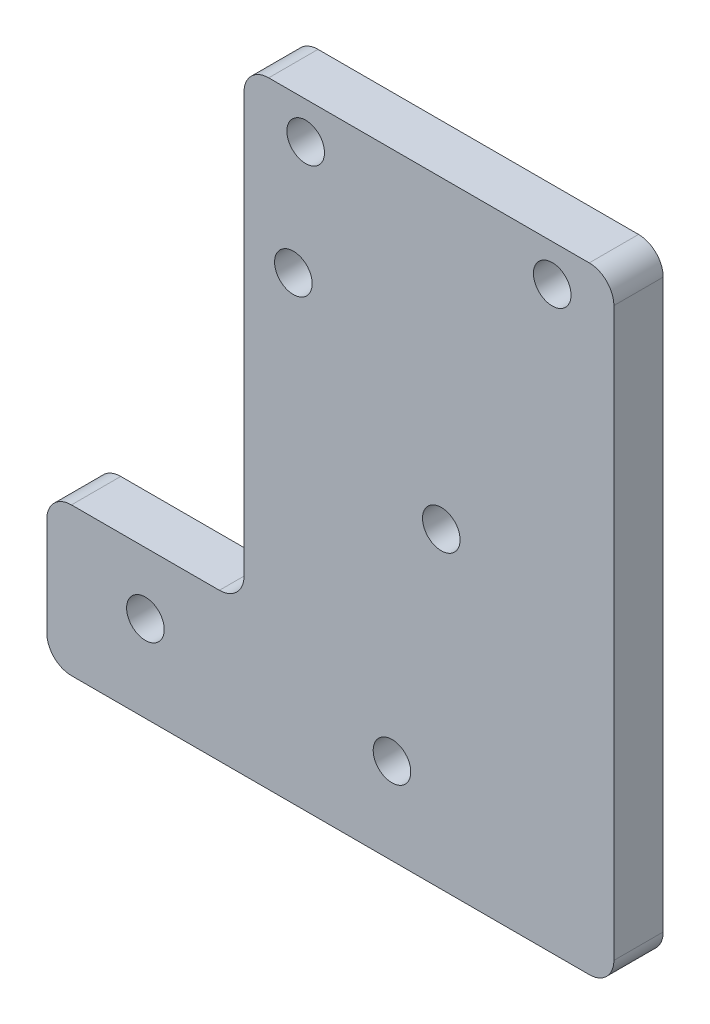
ISO-10303-21;
HEADER;
FILE_DESCRIPTION(('STEP AP214'),'2;1');
FILE_NAME('part.step','',(''),(''),'','','');
FILE_SCHEMA(('AUTOMOTIVE_DESIGN { 1 0 10303 214 1 1 1 1 }'));
ENDSEC;
DATA;
#1=APPLICATION_CONTEXT('core data for automotive mechanical design processes');
#2=APPLICATION_PROTOCOL_DEFINITION('international standard','automotive_design',2000,#1);
#3=PRODUCT_CONTEXT('',#1,'mechanical');
#4=PRODUCT('Part','Part','',(#3));
#5=PRODUCT_RELATED_PRODUCT_CATEGORY('part','',(#4));
#6=PRODUCT_DEFINITION_FORMATION('','',#4);
#7=PRODUCT_DEFINITION_CONTEXT('part definition',#1,'design');
#8=PRODUCT_DEFINITION('design','',#6,#7);
#9=PRODUCT_DEFINITION_SHAPE('','',#8);
#10=(LENGTH_UNIT() NAMED_UNIT(*) SI_UNIT(.MILLI.,.METRE.));
#11=(NAMED_UNIT(*) PLANE_ANGLE_UNIT() SI_UNIT($,.RADIAN.));
#12=(NAMED_UNIT(*) SI_UNIT($,.STERADIAN.) SOLID_ANGLE_UNIT());
#13=UNCERTAINTY_MEASURE_WITH_UNIT(LENGTH_MEASURE(1.E-05),#10,'distance_accuracy_value','');
#14=(GEOMETRIC_REPRESENTATION_CONTEXT(3) GLOBAL_UNCERTAINTY_ASSIGNED_CONTEXT((#13)) GLOBAL_UNIT_ASSIGNED_CONTEXT((#10,
#11,#12)) REPRESENTATION_CONTEXT('',''));
#15=CARTESIAN_POINT('',(0.,0.,0.));
#16=DIRECTION('',(0.,0.,1.));
#17=DIRECTION('',(1.,0.,0.));
#18=AXIS2_PLACEMENT_3D('',#15,#16,#17);
#19=CARTESIAN_POINT('',(15.,-15.,2.));
#20=DIRECTION('',(-1.,0.,0.));
#21=DIRECTION('',(0.,0.,1.));
#22=AXIS2_PLACEMENT_3D('',#19,#20,#21);
#23=PLANE('',#22);
#24=DIRECTION('',(0.,1.,0.));
#25=VECTOR('',#24,1.);
#26=CARTESIAN_POINT('',(15.,-15.,-2.));
#27=LINE('',#26,#25);
#28=CARTESIAN_POINT('',(15.,-33.,-2.));
#29=VERTEX_POINT('',#28);
#30=CARTESIAN_POINT('',(15.,13.,-2.));
#31=VERTEX_POINT('',#30);
#32=EDGE_CURVE('E152',#29,#31,#27,.T.);
#33=ORIENTED_EDGE('',*,*,#32,.T.);
#34=DIRECTION('',(0.,0.,-1.));
#35=VECTOR('',#34,1.);
#36=CARTESIAN_POINT('',(15.,13.,2.));
#37=LINE('',#36,#35);
#38=CARTESIAN_POINT('',(15.,13.,2.));
#39=VERTEX_POINT('',#38);
#40=EDGE_CURVE('E130',#31,#39,#37,.F.);
#41=ORIENTED_EDGE('',*,*,#40,.T.);
#42=DIRECTION('',(0.,1.,0.));
#43=VECTOR('',#42,1.);
#44=CARTESIAN_POINT('',(15.,-15.,2.));
#45=LINE('',#44,#43);
#46=CARTESIAN_POINT('',(15.,-33.,2.));
#47=VERTEX_POINT('',#46);
#48=EDGE_CURVE('E155',#47,#39,#45,.T.);
#49=ORIENTED_EDGE('',*,*,#48,.F.);
#50=DIRECTION('',(0.,0.,1.));
#51=VECTOR('',#50,1.);
#52=CARTESIAN_POINT('',(15.,-33.,-2.));
#53=LINE('',#52,#51);
#54=EDGE_CURVE('E135',#47,#29,#53,.F.);
#55=ORIENTED_EDGE('',*,*,#54,.T.);
#56=EDGE_LOOP('',(#33,#41,#49,#55));
#57=FACE_BOUND('',#56,.T.);
#58=ADVANCED_FACE('F35',(#57),#23,.F.);
#59=CARTESIAN_POINT('',(-15.,15.,2.));
#60=DIRECTION('',(0.,-1.,0.));
#61=DIRECTION('',(0.,0.,-1.));
#62=AXIS2_PLACEMENT_3D('',#59,#60,#61);
#63=PLANE('',#62);
#64=DIRECTION('',(-1.,0.,0.));
#65=VECTOR('',#64,1.);
#66=CARTESIAN_POINT('',(-15.,15.,2.));
#67=LINE('',#66,#65);
#68=CARTESIAN_POINT('',(13.,15.,2.));
#69=VERTEX_POINT('',#68);
#70=CARTESIAN_POINT('',(-13.,15.,2.));
#71=VERTEX_POINT('',#70);
#72=EDGE_CURVE('E145',#69,#71,#67,.T.);
#73=ORIENTED_EDGE('',*,*,#72,.F.);
#74=DIRECTION('',(0.,0.,-1.));
#75=VECTOR('',#74,1.);
#76=CARTESIAN_POINT('',(13.,15.,2.));
#77=LINE('',#76,#75);
#78=CARTESIAN_POINT('',(13.,15.,-2.));
#79=VERTEX_POINT('',#78);
#80=EDGE_CURVE('E129',#69,#79,#77,.T.);
#81=ORIENTED_EDGE('',*,*,#80,.T.);
#82=DIRECTION('',(-1.,0.,0.));
#83=VECTOR('',#82,1.);
#84=CARTESIAN_POINT('',(-15.,15.,-2.));
#85=LINE('',#84,#83);
#86=CARTESIAN_POINT('',(-13.,15.,-2.));
#87=VERTEX_POINT('',#86);
#88=EDGE_CURVE('E142',#79,#87,#85,.T.);
#89=ORIENTED_EDGE('',*,*,#88,.T.);
#90=DIRECTION('',(0.,0.,-1.));
#91=VECTOR('',#90,1.);
#92=CARTESIAN_POINT('',(-13.,15.,2.));
#93=LINE('',#92,#91);
#94=EDGE_CURVE('E147',#87,#71,#93,.F.);
#95=ORIENTED_EDGE('',*,*,#94,.T.);
#96=EDGE_LOOP('',(#73,#81,#89,#95));
#97=FACE_BOUND('',#96,.T.);
#98=ADVANCED_FACE('F141',(#97),#63,.F.);
#99=CARTESIAN_POINT('',(-15.,-15.,2.));
#100=DIRECTION('',(1.,0.,0.));
#101=DIRECTION('',(0.,0.,-1.));
#102=AXIS2_PLACEMENT_3D('',#99,#100,#101);
#103=PLANE('',#102);
#104=DIRECTION('',(0.,-1.,0.));
#105=VECTOR('',#104,1.);
#106=CARTESIAN_POINT('',(-15.,-15.,2.));
#107=LINE('',#106,#105);
#108=CARTESIAN_POINT('',(-15.,13.,2.));
#109=VERTEX_POINT('',#108);
#110=CARTESIAN_POINT('',(-15.,-21.,2.));
#111=VERTEX_POINT('',#110);
#112=EDGE_CURVE('E175',#109,#111,#107,.T.);
#113=ORIENTED_EDGE('',*,*,#112,.F.);
#114=DIRECTION('',(0.,0.,-1.));
#115=VECTOR('',#114,1.);
#116=CARTESIAN_POINT('',(-15.,13.,2.));
#117=LINE('',#116,#115);
#118=CARTESIAN_POINT('',(-15.,13.,-2.));
#119=VERTEX_POINT('',#118);
#120=EDGE_CURVE('E196',#109,#119,#117,.T.);
#121=ORIENTED_EDGE('',*,*,#120,.T.);
#122=DIRECTION('',(0.,-1.,0.));
#123=VECTOR('',#122,1.);
#124=CARTESIAN_POINT('',(-15.,-15.,-2.));
#125=LINE('',#124,#123);
#126=CARTESIAN_POINT('',(-15.,-21.,-2.));
#127=VERTEX_POINT('',#126);
#128=EDGE_CURVE('E151',#119,#127,#125,.T.);
#129=ORIENTED_EDGE('',*,*,#128,.T.);
#130=DIRECTION('',(0.,0.,1.));
#131=VECTOR('',#130,1.);
#132=CARTESIAN_POINT('',(-15.,-21.,2.));
#133=LINE('',#132,#131);
#134=EDGE_CURVE('E193',#127,#111,#133,.T.);
#135=ORIENTED_EDGE('',*,*,#134,.T.);
#136=EDGE_LOOP('',(#113,#121,#129,#135));
#137=FACE_BOUND('',#136,.T.);
#138=ADVANCED_FACE('F234',(#137),#103,.F.);
#139=CARTESIAN_POINT('',(0.,0.,2.));
#140=DIRECTION('',(0.,0.,-1.));
#141=DIRECTION('',(-1.,0.,0.));
#142=AXIS2_PLACEMENT_3D('',#139,#140,#141);
#143=PLANE('',#142);
#144=CARTESIAN_POINT('',(-2.99999999999999,-28.,2.));
#145=DIRECTION('',(0.,0.,-1.));
#146=DIRECTION('',(-1.,0.,0.));
#147=AXIS2_PLACEMENT_3D('',#144,#145,#146);
#148=CIRCLE('',#147,1.525);
#149=CARTESIAN_POINT('',(-4.52499999999999,-28.,2.));
#150=VERTEX_POINT('',#149);
#151=EDGE_CURVE('E228',#150,#150,#148,.T.);
#152=ORIENTED_EDGE('',*,*,#151,.T.);
#153=EDGE_LOOP('',(#152));
#154=FACE_BOUND('',#153,.T.);
#155=CARTESIAN_POINT('',(-23.,-28.,2.));
#156=DIRECTION('',(0.,0.,-1.));
#157=DIRECTION('',(-1.,0.,0.));
#158=AXIS2_PLACEMENT_3D('',#155,#156,#157);
#159=CIRCLE('',#158,1.525);
#160=CARTESIAN_POINT('',(-24.525,-28.,2.));
#161=VERTEX_POINT('',#160);
#162=EDGE_CURVE('E264',#161,#161,#159,.T.);
#163=ORIENTED_EDGE('',*,*,#162,.T.);
#164=EDGE_LOOP('',(#163));
#165=FACE_BOUND('',#164,.T.);
#166=CARTESIAN_POINT('',(0.999999999998277,-9.70000000000001,2.));
#167=DIRECTION('',(0.,0.,1.));
#168=DIRECTION('',(1.,0.,0.));
#169=AXIS2_PLACEMENT_3D('',#166,#167,#168);
#170=CIRCLE('',#169,1.525);
#171=CARTESIAN_POINT('',(2.52499999999828,-9.70000000000001,2.));
#172=VERTEX_POINT('',#171);
#173=EDGE_CURVE('E165',#172,#172,#170,.T.);
#174=ORIENTED_EDGE('',*,*,#173,.F.);
#175=EDGE_LOOP('',(#174));
#176=FACE_BOUND('',#175,.T.);
#177=CARTESIAN_POINT('',(-11.0000000000017,2.29999999999999,2.));
#178=DIRECTION('',(0.,0.,1.));
#179=DIRECTION('',(1.,0.,0.));
#180=AXIS2_PLACEMENT_3D('',#177,#178,#179);
#181=CIRCLE('',#180,1.525);
#182=CARTESIAN_POINT('',(-9.47500000000172,2.29999999999999,2.));
#183=VERTEX_POINT('',#182);
#184=EDGE_CURVE('E252',#183,#183,#181,.T.);
#185=ORIENTED_EDGE('',*,*,#184,.F.);
#186=EDGE_LOOP('',(#185));
#187=FACE_BOUND('',#186,.T.);
#188=CARTESIAN_POINT('',(-10.,12.,2.));
#189=DIRECTION('',(0.,0.,1.));
#190=DIRECTION('',(1.,0.,0.));
#191=AXIS2_PLACEMENT_3D('',#188,#189,#190);
#192=CIRCLE('',#191,1.525);
#193=CARTESIAN_POINT('',(-8.475,12.,2.));
#194=VERTEX_POINT('',#193);
#195=EDGE_CURVE('E248',#194,#194,#192,.T.);
#196=ORIENTED_EDGE('',*,*,#195,.F.);
#197=EDGE_LOOP('',(#196));
#198=FACE_BOUND('',#197,.T.);
#199=CARTESIAN_POINT('',(10.,12.,2.));
#200=DIRECTION('',(0.,0.,1.));
#201=DIRECTION('',(1.,0.,0.));
#202=AXIS2_PLACEMENT_3D('',#199,#200,#201);
#203=CIRCLE('',#202,1.525);
#204=CARTESIAN_POINT('',(11.525,12.,2.));
#205=VERTEX_POINT('',#204);
#206=EDGE_CURVE('E245',#205,#205,#203,.T.);
#207=ORIENTED_EDGE('',*,*,#206,.F.);
#208=EDGE_LOOP('',(#207));
#209=FACE_BOUND('',#208,.T.);
#210=ORIENTED_EDGE('',*,*,#48,.T.);
#211=CARTESIAN_POINT('',(13.,13.,2.));
#212=DIRECTION('',(0.,0.,-1.));
#213=DIRECTION('',(-1.,0.,0.));
#214=AXIS2_PLACEMENT_3D('',#211,#212,#213);
#215=CIRCLE('',#214,2.);
#216=EDGE_CURVE('E191',#39,#69,#215,.F.);
#217=ORIENTED_EDGE('',*,*,#216,.T.);
#218=ORIENTED_EDGE('',*,*,#72,.T.);
#219=CARTESIAN_POINT('',(-13.,13.,2.));
#220=DIRECTION('',(0.,0.,-1.));
#221=DIRECTION('',(-1.,0.,0.));
#222=AXIS2_PLACEMENT_3D('',#219,#220,#221);
#223=CIRCLE('',#222,2.);
#224=EDGE_CURVE('E189',#71,#109,#223,.F.);
#225=ORIENTED_EDGE('',*,*,#224,.T.);
#226=ORIENTED_EDGE('',*,*,#112,.T.);
#227=CARTESIAN_POINT('',(-17.,-21.,2.));
#228=DIRECTION('',(0.,0.,-1.));
#229=DIRECTION('',(-1.,0.,0.));
#230=AXIS2_PLACEMENT_3D('',#227,#228,#229);
#231=CIRCLE('',#230,2.);
#232=CARTESIAN_POINT('',(-17.,-23.,2.));
#233=VERTEX_POINT('',#232);
#234=EDGE_CURVE('E43',#111,#233,#231,.T.);
#235=ORIENTED_EDGE('',*,*,#234,.T.);
#236=DIRECTION('',(-1.,0.,0.));
#237=VECTOR('',#236,1.);
#238=CARTESIAN_POINT('',(-31.,-23.,2.));
#239=LINE('',#238,#237);
#240=CARTESIAN_POINT('',(-29.,-23.,2.));
#241=VERTEX_POINT('',#240);
#242=EDGE_CURVE('E217',#233,#241,#239,.T.);
#243=ORIENTED_EDGE('',*,*,#242,.T.);
#244=CARTESIAN_POINT('',(-29.,-25.,2.));
#245=DIRECTION('',(0.,0.,-1.));
#246=DIRECTION('',(-1.,0.,0.));
#247=AXIS2_PLACEMENT_3D('',#244,#245,#246);
#248=CIRCLE('',#247,2.);
#249=CARTESIAN_POINT('',(-31.,-25.,2.));
#250=VERTEX_POINT('',#249);
#251=EDGE_CURVE('E185',#241,#250,#248,.F.);
#252=ORIENTED_EDGE('',*,*,#251,.T.);
#253=DIRECTION('',(0.,-1.,0.));
#254=VECTOR('',#253,1.);
#255=CARTESIAN_POINT('',(-31.,-35.,2.));
#256=LINE('',#255,#254);
#257=CARTESIAN_POINT('',(-31.,-33.,2.));
#258=VERTEX_POINT('',#257);
#259=EDGE_CURVE('E227',#250,#258,#256,.T.);
#260=ORIENTED_EDGE('',*,*,#259,.T.);
#261=CARTESIAN_POINT('',(-29.,-33.,2.));
#262=DIRECTION('',(0.,0.,-1.));
#263=DIRECTION('',(-1.,0.,0.));
#264=AXIS2_PLACEMENT_3D('',#261,#262,#263);
#265=CIRCLE('',#264,2.);
#266=CARTESIAN_POINT('',(-29.,-35.,2.));
#267=VERTEX_POINT('',#266);
#268=EDGE_CURVE('E58',#258,#267,#265,.F.);
#269=ORIENTED_EDGE('',*,*,#268,.T.);
#270=DIRECTION('',(1.,0.,0.));
#271=VECTOR('',#270,1.);
#272=CARTESIAN_POINT('',(-15.,-35.,2.));
#273=LINE('',#272,#271);
#274=CARTESIAN_POINT('',(13.,-35.,2.));
#275=VERTEX_POINT('',#274);
#276=EDGE_CURVE('E174',#267,#275,#273,.T.);
#277=ORIENTED_EDGE('',*,*,#276,.T.);
#278=CARTESIAN_POINT('',(13.,-33.,2.));
#279=DIRECTION('',(0.,0.,-1.));
#280=DIRECTION('',(-1.,0.,0.));
#281=AXIS2_PLACEMENT_3D('',#278,#279,#280);
#282=CIRCLE('',#281,2.);
#283=EDGE_CURVE('E50',#275,#47,#282,.F.);
#284=ORIENTED_EDGE('',*,*,#283,.T.);
#285=EDGE_LOOP('',(#210,#217,#218,#225,#226,#235,#243,#252,#260,#269,#277,#284));
#286=FACE_BOUND('',#285,.T.);
#287=ADVANCED_FACE('F216',(#154,#165,#176,#187,#198,#209,#286),#143,.F.);
#288=CARTESIAN_POINT('',(0.,0.,-2.));
#289=DIRECTION('',(0.,0.,-1.));
#290=DIRECTION('',(-1.,0.,0.));
#291=AXIS2_PLACEMENT_3D('',#288,#289,#290);
#292=PLANE('',#291);
#293=CARTESIAN_POINT('',(-2.99999999999999,-28.,-2.));
#294=DIRECTION('',(0.,0.,-1.));
#295=DIRECTION('',(-1.,0.,0.));
#296=AXIS2_PLACEMENT_3D('',#293,#294,#295);
#297=CIRCLE('',#296,1.525);
#298=CARTESIAN_POINT('',(-4.52499999999999,-28.,-2.));
#299=VERTEX_POINT('',#298);
#300=EDGE_CURVE('E267',#299,#299,#297,.T.);
#301=ORIENTED_EDGE('',*,*,#300,.F.);
#302=EDGE_LOOP('',(#301));
#303=FACE_BOUND('',#302,.T.);
#304=CARTESIAN_POINT('',(-23.,-28.,-2.));
#305=DIRECTION('',(0.,0.,-1.));
#306=DIRECTION('',(-1.,0.,0.));
#307=AXIS2_PLACEMENT_3D('',#304,#305,#306);
#308=CIRCLE('',#307,1.525);
#309=CARTESIAN_POINT('',(-24.525,-28.,-2.));
#310=VERTEX_POINT('',#309);
#311=EDGE_CURVE('E261',#310,#310,#308,.T.);
#312=ORIENTED_EDGE('',*,*,#311,.F.);
#313=EDGE_LOOP('',(#312));
#314=FACE_BOUND('',#313,.T.);
#315=CARTESIAN_POINT('',(0.999999999998277,-9.70000000000001,-2.));
#316=DIRECTION('',(0.,0.,-1.));
#317=DIRECTION('',(-1.,0.,0.));
#318=AXIS2_PLACEMENT_3D('',#315,#316,#317);
#319=CIRCLE('',#318,1.525);
#320=CARTESIAN_POINT('',(-0.525000000001723,-9.70000000000001,-2.));
#321=VERTEX_POINT('',#320);
#322=EDGE_CURVE('E171',#321,#321,#319,.T.);
#323=ORIENTED_EDGE('',*,*,#322,.F.);
#324=EDGE_LOOP('',(#323));
#325=FACE_BOUND('',#324,.T.);
#326=CARTESIAN_POINT('',(-11.0000000000017,2.29999999999999,-2.));
#327=DIRECTION('',(0.,0.,-1.));
#328=DIRECTION('',(-1.,0.,0.));
#329=AXIS2_PLACEMENT_3D('',#326,#327,#328);
#330=CIRCLE('',#329,1.525);
#331=CARTESIAN_POINT('',(-12.5250000000017,2.29999999999999,-2.));
#332=VERTEX_POINT('',#331);
#333=EDGE_CURVE('E168',#332,#332,#330,.T.);
#334=ORIENTED_EDGE('',*,*,#333,.F.);
#335=EDGE_LOOP('',(#334));
#336=FACE_BOUND('',#335,.T.);
#337=CARTESIAN_POINT('',(-10.,12.,-2.));
#338=DIRECTION('',(0.,0.,-1.));
#339=DIRECTION('',(-1.,0.,0.));
#340=AXIS2_PLACEMENT_3D('',#337,#338,#339);
#341=CIRCLE('',#340,1.525);
#342=CARTESIAN_POINT('',(-11.525,12.,-2.));
#343=VERTEX_POINT('',#342);
#344=EDGE_CURVE('E164',#343,#343,#341,.T.);
#345=ORIENTED_EDGE('',*,*,#344,.F.);
#346=EDGE_LOOP('',(#345));
#347=FACE_BOUND('',#346,.T.);
#348=CARTESIAN_POINT('',(10.,12.,-2.));
#349=DIRECTION('',(0.,0.,-1.));
#350=DIRECTION('',(-1.,0.,0.));
#351=AXIS2_PLACEMENT_3D('',#348,#349,#350);
#352=CIRCLE('',#351,1.525);
#353=CARTESIAN_POINT('',(8.475,12.,-2.));
#354=VERTEX_POINT('',#353);
#355=EDGE_CURVE('E161',#354,#354,#352,.T.);
#356=ORIENTED_EDGE('',*,*,#355,.F.);
#357=EDGE_LOOP('',(#356));
#358=FACE_BOUND('',#357,.T.);
#359=ORIENTED_EDGE('',*,*,#88,.F.);
#360=CARTESIAN_POINT('',(13.,13.,-2.));
#361=DIRECTION('',(0.,0.,-1.));
#362=DIRECTION('',(-1.,0.,0.));
#363=AXIS2_PLACEMENT_3D('',#360,#361,#362);
#364=CIRCLE('',#363,2.);
#365=EDGE_CURVE('E125',#79,#31,#364,.T.);
#366=ORIENTED_EDGE('',*,*,#365,.T.);
#367=ORIENTED_EDGE('',*,*,#32,.F.);
#368=CARTESIAN_POINT('',(13.,-33.,-2.));
#369=DIRECTION('',(0.,0.,-1.));
#370=DIRECTION('',(-1.,0.,0.));
#371=AXIS2_PLACEMENT_3D('',#368,#369,#370);
#372=CIRCLE('',#371,2.);
#373=CARTESIAN_POINT('',(13.,-35.,-2.));
#374=VERTEX_POINT('',#373);
#375=EDGE_CURVE('E180',#29,#374,#372,.T.);
#376=ORIENTED_EDGE('',*,*,#375,.T.);
#377=DIRECTION('',(1.,0.,0.));
#378=VECTOR('',#377,1.);
#379=CARTESIAN_POINT('',(-15.,-35.,-2.));
#380=LINE('',#379,#378);
#381=CARTESIAN_POINT('',(-29.,-35.,-2.));
#382=VERTEX_POINT('',#381);
#383=EDGE_CURVE('E157',#382,#374,#380,.T.);
#384=ORIENTED_EDGE('',*,*,#383,.F.);
#385=CARTESIAN_POINT('',(-29.,-33.,-2.));
#386=DIRECTION('',(0.,0.,-1.));
#387=DIRECTION('',(-1.,0.,0.));
#388=AXIS2_PLACEMENT_3D('',#385,#386,#387);
#389=CIRCLE('',#388,2.);
#390=CARTESIAN_POINT('',(-31.,-33.,-2.));
#391=VERTEX_POINT('',#390);
#392=EDGE_CURVE('E178',#382,#391,#389,.T.);
#393=ORIENTED_EDGE('',*,*,#392,.T.);
#394=DIRECTION('',(0.,-1.,0.));
#395=VECTOR('',#394,1.);
#396=CARTESIAN_POINT('',(-31.,-35.,-2.));
#397=LINE('',#396,#395);
#398=CARTESIAN_POINT('',(-31.,-25.,-2.));
#399=VERTEX_POINT('',#398);
#400=EDGE_CURVE('E249',#399,#391,#397,.T.);
#401=ORIENTED_EDGE('',*,*,#400,.F.);
#402=CARTESIAN_POINT('',(-29.,-25.,-2.));
#403=DIRECTION('',(0.,0.,-1.));
#404=DIRECTION('',(-1.,0.,0.));
#405=AXIS2_PLACEMENT_3D('',#402,#403,#404);
#406=CIRCLE('',#405,2.);
#407=CARTESIAN_POINT('',(-29.,-23.,-2.));
#408=VERTEX_POINT('',#407);
#409=EDGE_CURVE('E146',#399,#408,#406,.T.);
#410=ORIENTED_EDGE('',*,*,#409,.T.);
#411=DIRECTION('',(-1.,0.,0.));
#412=VECTOR('',#411,1.);
#413=CARTESIAN_POINT('',(-31.,-23.,-2.));
#414=LINE('',#413,#412);
#415=CARTESIAN_POINT('',(-17.,-23.,-2.));
#416=VERTEX_POINT('',#415);
#417=EDGE_CURVE('E232',#416,#408,#414,.T.);
#418=ORIENTED_EDGE('',*,*,#417,.F.);
#419=CARTESIAN_POINT('',(-17.,-21.,-2.));
#420=DIRECTION('',(0.,0.,-1.));
#421=DIRECTION('',(-1.,0.,0.));
#422=AXIS2_PLACEMENT_3D('',#419,#420,#421);
#423=CIRCLE('',#422,2.);
#424=EDGE_CURVE('E11',#416,#127,#423,.F.);
#425=ORIENTED_EDGE('',*,*,#424,.T.);
#426=ORIENTED_EDGE('',*,*,#128,.F.);
#427=CARTESIAN_POINT('',(-13.,13.,-2.));
#428=DIRECTION('',(0.,0.,-1.));
#429=DIRECTION('',(-1.,0.,0.));
#430=AXIS2_PLACEMENT_3D('',#427,#428,#429);
#431=CIRCLE('',#430,2.);
#432=EDGE_CURVE('E136',#119,#87,#431,.T.);
#433=ORIENTED_EDGE('',*,*,#432,.T.);
#434=EDGE_LOOP('',(#359,#366,#367,#376,#384,#393,#401,#410,#418,#425,#426,#433));
#435=FACE_BOUND('',#434,.T.);
#436=ADVANCED_FACE('F149',(#303,#314,#325,#336,#347,#358,#435),#292,.T.);
#437=CARTESIAN_POINT('',(-15.,-35.,-38.0555127546399));
#438=DIRECTION('',(0.,-1.,0.));
#439=DIRECTION('',(0.,0.,-1.));
#440=AXIS2_PLACEMENT_3D('',#437,#438,#439);
#441=PLANE('',#440);
#442=ORIENTED_EDGE('',*,*,#383,.T.);
#443=DIRECTION('',(0.,0.,1.));
#444=VECTOR('',#443,1.);
#445=CARTESIAN_POINT('',(13.,-35.,2.));
#446=LINE('',#445,#444);
#447=EDGE_CURVE('E206',#374,#275,#446,.T.);
#448=ORIENTED_EDGE('',*,*,#447,.T.);
#449=ORIENTED_EDGE('',*,*,#276,.F.);
#450=DIRECTION('',(0.,0.,1.));
#451=VECTOR('',#450,1.);
#452=CARTESIAN_POINT('',(-29.,-35.,-38.0555127546399));
#453=LINE('',#452,#451);
#454=EDGE_CURVE('E204',#267,#382,#453,.F.);
#455=ORIENTED_EDGE('',*,*,#454,.T.);
#456=EDGE_LOOP('',(#442,#448,#449,#455));
#457=FACE_BOUND('',#456,.T.);
#458=ADVANCED_FACE('F284',(#457),#441,.T.);
#459=CARTESIAN_POINT('',(10.,12.,-78.));
#460=DIRECTION('',(0.,0.,1.));
#461=DIRECTION('',(1.,0.,0.));
#462=AXIS2_PLACEMENT_3D('',#459,#460,#461);
#463=CYLINDRICAL_SURFACE('',#462,1.525);
#464=ORIENTED_EDGE('',*,*,#355,.T.);
#465=EDGE_LOOP('',(#464));
#466=FACE_BOUND('',#465,.T.);
#467=ORIENTED_EDGE('',*,*,#206,.T.);
#468=EDGE_LOOP('',(#467));
#469=FACE_BOUND('',#468,.T.);
#470=ADVANCED_FACE('F296',(#466,#469),#463,.F.);
#471=CARTESIAN_POINT('',(-10.,12.,-78.));
#472=DIRECTION('',(0.,0.,1.));
#473=DIRECTION('',(1.,0.,0.));
#474=AXIS2_PLACEMENT_3D('',#471,#472,#473);
#475=CYLINDRICAL_SURFACE('',#474,1.525);
#476=ORIENTED_EDGE('',*,*,#344,.T.);
#477=EDGE_LOOP('',(#476));
#478=FACE_BOUND('',#477,.T.);
#479=ORIENTED_EDGE('',*,*,#195,.T.);
#480=EDGE_LOOP('',(#479));
#481=FACE_BOUND('',#480,.T.);
#482=ADVANCED_FACE('F299',(#478,#481),#475,.F.);
#483=CARTESIAN_POINT('',(-11.0000000000017,2.29999999999999,-78.));
#484=DIRECTION('',(0.,0.,1.));
#485=DIRECTION('',(1.,0.,0.));
#486=AXIS2_PLACEMENT_3D('',#483,#484,#485);
#487=CYLINDRICAL_SURFACE('',#486,1.525);
#488=ORIENTED_EDGE('',*,*,#333,.T.);
#489=EDGE_LOOP('',(#488));
#490=FACE_BOUND('',#489,.T.);
#491=ORIENTED_EDGE('',*,*,#184,.T.);
#492=EDGE_LOOP('',(#491));
#493=FACE_BOUND('',#492,.T.);
#494=ADVANCED_FACE('F356',(#490,#493),#487,.F.);
#495=CARTESIAN_POINT('',(0.999999999998277,-9.70000000000001,-78.));
#496=DIRECTION('',(0.,0.,1.));
#497=DIRECTION('',(1.,0.,0.));
#498=AXIS2_PLACEMENT_3D('',#495,#496,#497);
#499=CYLINDRICAL_SURFACE('',#498,1.525);
#500=ORIENTED_EDGE('',*,*,#322,.T.);
#501=EDGE_LOOP('',(#500));
#502=FACE_BOUND('',#501,.T.);
#503=ORIENTED_EDGE('',*,*,#173,.T.);
#504=EDGE_LOOP('',(#503));
#505=FACE_BOUND('',#504,.T.);
#506=ADVANCED_FACE('F351',(#502,#505),#499,.F.);
#507=CARTESIAN_POINT('',(-31.,-23.,-22.));
#508=DIRECTION('',(0.,1.,0.));
#509=DIRECTION('',(-1.,0.,0.));
#510=AXIS2_PLACEMENT_3D('',#507,#508,#509);
#511=PLANE('',#510);
#512=ORIENTED_EDGE('',*,*,#242,.F.);
#513=DIRECTION('',(0.,0.,1.));
#514=VECTOR('',#513,1.);
#515=CARTESIAN_POINT('',(-17.,-23.,-22.));
#516=LINE('',#515,#514);
#517=EDGE_CURVE('E202',#233,#416,#516,.F.);
#518=ORIENTED_EDGE('',*,*,#517,.T.);
#519=ORIENTED_EDGE('',*,*,#417,.T.);
#520=DIRECTION('',(0.,0.,1.));
#521=VECTOR('',#520,1.);
#522=CARTESIAN_POINT('',(-29.,-23.,-22.));
#523=LINE('',#522,#521);
#524=EDGE_CURVE('E199',#408,#241,#523,.T.);
#525=ORIENTED_EDGE('',*,*,#524,.T.);
#526=EDGE_LOOP('',(#512,#518,#519,#525));
#527=FACE_BOUND('',#526,.T.);
#528=ADVANCED_FACE('F223',(#527),#511,.T.);
#529=CARTESIAN_POINT('',(-31.,-35.,-22.));
#530=DIRECTION('',(-1.,0.,0.));
#531=DIRECTION('',(0.,-1.,0.));
#532=AXIS2_PLACEMENT_3D('',#529,#530,#531);
#533=PLANE('',#532);
#534=ORIENTED_EDGE('',*,*,#400,.T.);
#535=DIRECTION('',(0.,0.,1.));
#536=VECTOR('',#535,1.);
#537=CARTESIAN_POINT('',(-31.,-33.,-22.));
#538=LINE('',#537,#536);
#539=EDGE_CURVE('E210',#391,#258,#538,.T.);
#540=ORIENTED_EDGE('',*,*,#539,.T.);
#541=ORIENTED_EDGE('',*,*,#259,.F.);
#542=DIRECTION('',(0.,0.,1.));
#543=VECTOR('',#542,1.);
#544=CARTESIAN_POINT('',(-31.,-25.,-22.));
#545=LINE('',#544,#543);
#546=EDGE_CURVE('E208',#250,#399,#545,.F.);
#547=ORIENTED_EDGE('',*,*,#546,.T.);
#548=EDGE_LOOP('',(#534,#540,#541,#547));
#549=FACE_BOUND('',#548,.T.);
#550=ADVANCED_FACE('F340',(#549),#533,.T.);
#551=CARTESIAN_POINT('',(-23.,-28.,2.));
#552=DIRECTION('',(0.,0.,-1.));
#553=DIRECTION('',(-1.,0.,0.));
#554=AXIS2_PLACEMENT_3D('',#551,#552,#553);
#555=CYLINDRICAL_SURFACE('',#554,1.525);
#556=ORIENTED_EDGE('',*,*,#162,.F.);
#557=EDGE_LOOP('',(#556));
#558=FACE_BOUND('',#557,.T.);
#559=ORIENTED_EDGE('',*,*,#311,.T.);
#560=EDGE_LOOP('',(#559));
#561=FACE_BOUND('',#560,.T.);
#562=ADVANCED_FACE('F278',(#558,#561),#555,.F.);
#563=CARTESIAN_POINT('',(-2.99999999999999,-28.,2.));
#564=DIRECTION('',(0.,0.,-1.));
#565=DIRECTION('',(-1.,0.,0.));
#566=AXIS2_PLACEMENT_3D('',#563,#564,#565);
#567=CYLINDRICAL_SURFACE('',#566,1.525);
#568=ORIENTED_EDGE('',*,*,#151,.F.);
#569=EDGE_LOOP('',(#568));
#570=FACE_BOUND('',#569,.T.);
#571=ORIENTED_EDGE('',*,*,#300,.T.);
#572=EDGE_LOOP('',(#571));
#573=FACE_BOUND('',#572,.T.);
#574=ADVANCED_FACE('F275',(#570,#573),#567,.F.);
#575=CARTESIAN_POINT('',(13.,13.,2.));
#576=DIRECTION('',(0.,0.,-1.));
#577=DIRECTION('',(-1.,0.,0.));
#578=AXIS2_PLACEMENT_3D('',#575,#576,#577);
#579=CYLINDRICAL_SURFACE('',#578,2.);
#580=ORIENTED_EDGE('',*,*,#216,.F.);
#581=ORIENTED_EDGE('',*,*,#40,.F.);
#582=ORIENTED_EDGE('',*,*,#365,.F.);
#583=ORIENTED_EDGE('',*,*,#80,.F.);
#584=EDGE_LOOP('',(#580,#581,#582,#583));
#585=FACE_BOUND('',#584,.T.);
#586=ADVANCED_FACE('F128',(#585),#579,.T.);
#587=CARTESIAN_POINT('',(-13.,13.,2.));
#588=DIRECTION('',(0.,0.,-1.));
#589=DIRECTION('',(-1.,0.,0.));
#590=AXIS2_PLACEMENT_3D('',#587,#588,#589);
#591=CYLINDRICAL_SURFACE('',#590,2.);
#592=ORIENTED_EDGE('',*,*,#224,.F.);
#593=ORIENTED_EDGE('',*,*,#94,.F.);
#594=ORIENTED_EDGE('',*,*,#432,.F.);
#595=ORIENTED_EDGE('',*,*,#120,.F.);
#596=EDGE_LOOP('',(#592,#593,#594,#595));
#597=FACE_BOUND('',#596,.T.);
#598=ADVANCED_FACE('F238',(#597),#591,.T.);
#599=CARTESIAN_POINT('',(-17.,-21.,2.));
#600=DIRECTION('',(0.,0.,1.));
#601=DIRECTION('',(1.,0.,0.));
#602=AXIS2_PLACEMENT_3D('',#599,#600,#601);
#603=CYLINDRICAL_SURFACE('',#602,2.);
#604=ORIENTED_EDGE('',*,*,#424,.F.);
#605=ORIENTED_EDGE('',*,*,#517,.F.);
#606=ORIENTED_EDGE('',*,*,#234,.F.);
#607=ORIENTED_EDGE('',*,*,#134,.F.);
#608=EDGE_LOOP('',(#604,#605,#606,#607));
#609=FACE_BOUND('',#608,.T.);
#610=ADVANCED_FACE('F231',(#609),#603,.F.);
#611=CARTESIAN_POINT('',(13.,-33.,-38.0555127546399));
#612=DIRECTION('',(0.,0.,-1.));
#613=DIRECTION('',(-1.,0.,0.));
#614=AXIS2_PLACEMENT_3D('',#611,#612,#613);
#615=CYLINDRICAL_SURFACE('',#614,2.);
#616=ORIENTED_EDGE('',*,*,#375,.F.);
#617=ORIENTED_EDGE('',*,*,#54,.F.);
#618=ORIENTED_EDGE('',*,*,#283,.F.);
#619=ORIENTED_EDGE('',*,*,#447,.F.);
#620=EDGE_LOOP('',(#616,#617,#618,#619));
#621=FACE_BOUND('',#620,.T.);
#622=ADVANCED_FACE('F324',(#621),#615,.T.);
#623=CARTESIAN_POINT('',(-29.,-33.,-22.));
#624=DIRECTION('',(0.,0.,1.));
#625=DIRECTION('',(1.,0.,0.));
#626=AXIS2_PLACEMENT_3D('',#623,#624,#625);
#627=CYLINDRICAL_SURFACE('',#626,2.);
#628=ORIENTED_EDGE('',*,*,#392,.F.);
#629=ORIENTED_EDGE('',*,*,#454,.F.);
#630=ORIENTED_EDGE('',*,*,#268,.F.);
#631=ORIENTED_EDGE('',*,*,#539,.F.);
#632=EDGE_LOOP('',(#628,#629,#630,#631));
#633=FACE_BOUND('',#632,.T.);
#634=ADVANCED_FACE('F326',(#633),#627,.T.);
#635=CARTESIAN_POINT('',(-29.,-25.,-22.));
#636=DIRECTION('',(0.,0.,1.));
#637=DIRECTION('',(1.,0.,0.));
#638=AXIS2_PLACEMENT_3D('',#635,#636,#637);
#639=CYLINDRICAL_SURFACE('',#638,2.);
#640=ORIENTED_EDGE('',*,*,#409,.F.);
#641=ORIENTED_EDGE('',*,*,#546,.F.);
#642=ORIENTED_EDGE('',*,*,#251,.F.);
#643=ORIENTED_EDGE('',*,*,#524,.F.);
#644=EDGE_LOOP('',(#640,#641,#642,#643));
#645=FACE_BOUND('',#644,.T.);
#646=ADVANCED_FACE('F37',(#645),#639,.T.);
#647=CLOSED_SHELL('',(#58,#98,#138,#287,#436,#458,#470,#482,#494,#506,#528,#550,#562,#574,#586,
#598,#610,#622,#634,#646));
#648=MANIFOLD_SOLID_BREP('B2',#647);
#649=ADVANCED_BREP_SHAPE_REPRESENTATION('',(#18,#648),#14);
#650=SHAPE_DEFINITION_REPRESENTATION(#9,#649);
ENDSEC;
END-ISO-10303-21;
